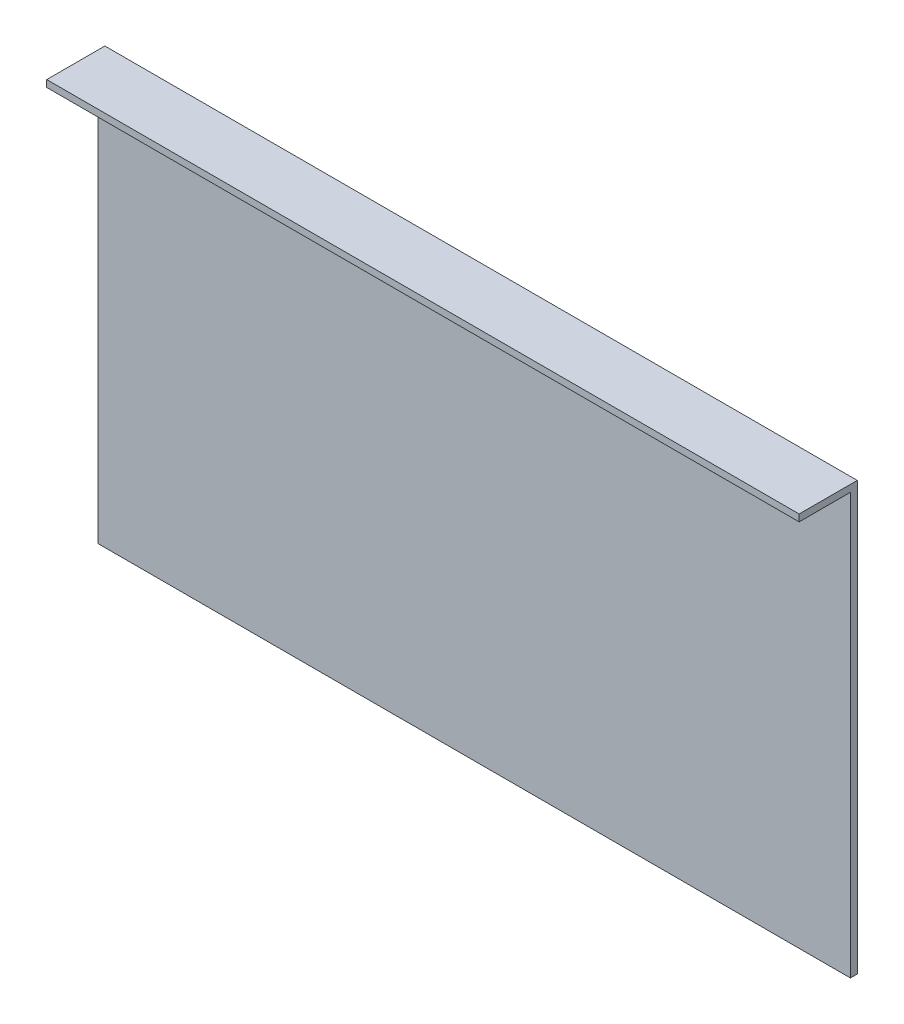
ISO-10303-21;
HEADER;
FILE_DESCRIPTION(('STEP AP214'),'2;1');
FILE_NAME('part.step','',(''),(''),'','','');
FILE_SCHEMA(('AUTOMOTIVE_DESIGN { 1 0 10303 214 1 1 1 1 }'));
ENDSEC;
DATA;
#1=APPLICATION_CONTEXT('core data for automotive mechanical design processes');
#2=APPLICATION_PROTOCOL_DEFINITION('international standard','automotive_design',2000,#1);
#3=PRODUCT_CONTEXT('',#1,'mechanical');
#4=PRODUCT('Part','Part','',(#3));
#5=PRODUCT_RELATED_PRODUCT_CATEGORY('part','',(#4));
#6=PRODUCT_DEFINITION_FORMATION('','',#4);
#7=PRODUCT_DEFINITION_CONTEXT('part definition',#1,'design');
#8=PRODUCT_DEFINITION('design','',#6,#7);
#9=PRODUCT_DEFINITION_SHAPE('','',#8);
#10=(LENGTH_UNIT() NAMED_UNIT(*) SI_UNIT(.MILLI.,.METRE.));
#11=(NAMED_UNIT(*) PLANE_ANGLE_UNIT() SI_UNIT($,.RADIAN.));
#12=(NAMED_UNIT(*) SI_UNIT($,.STERADIAN.) SOLID_ANGLE_UNIT());
#13=UNCERTAINTY_MEASURE_WITH_UNIT(LENGTH_MEASURE(1.E-05),#10,'distance_accuracy_value','');
#14=(GEOMETRIC_REPRESENTATION_CONTEXT(3) GLOBAL_UNCERTAINTY_ASSIGNED_CONTEXT((#13)) GLOBAL_UNIT_ASSIGNED_CONTEXT((#10,
#11,#12)) REPRESENTATION_CONTEXT('',''));
#15=CARTESIAN_POINT('',(0.,0.,0.));
#16=DIRECTION('',(0.,0.,1.));
#17=DIRECTION('',(1.,0.,0.));
#18=AXIS2_PLACEMENT_3D('',#15,#16,#17);
#19=CARTESIAN_POINT('',(0.,0.,4.));
#20=DIRECTION('',(0.,0.,-1.));
#21=DIRECTION('',(-1.,0.,0.));
#22=AXIS2_PLACEMENT_3D('',#19,#20,#21);
#23=PLANE('',#22);
#24=DIRECTION('',(1.,0.,0.));
#25=VECTOR('',#24,1.);
#26=CARTESIAN_POINT('',(0.,246.,4.));
#27=LINE('',#26,#25);
#28=CARTESIAN_POINT('',(0.,246.,4.));
#29=VERTEX_POINT('',#28);
#30=CARTESIAN_POINT('',(440.,246.,4.));
#31=VERTEX_POINT('',#30);
#32=EDGE_CURVE('E49',#29,#31,#27,.T.);
#33=ORIENTED_EDGE('',*,*,#32,.F.);
#34=DIRECTION('',(0.,-1.,0.));
#35=VECTOR('',#34,1.);
#36=CARTESIAN_POINT('',(0.,0.,4.));
#37=LINE('',#36,#35);
#38=CARTESIAN_POINT('',(0.,0.,4.));
#39=VERTEX_POINT('',#38);
#40=EDGE_CURVE('E86',#29,#39,#37,.T.);
#41=ORIENTED_EDGE('',*,*,#40,.T.);
#42=DIRECTION('',(1.,0.,0.));
#43=VECTOR('',#42,1.);
#44=CARTESIAN_POINT('',(0.,0.,4.));
#45=LINE('',#44,#43);
#46=CARTESIAN_POINT('',(440.,0.,4.));
#47=VERTEX_POINT('',#46);
#48=EDGE_CURVE('E55',#39,#47,#45,.T.);
#49=ORIENTED_EDGE('',*,*,#48,.T.);
#50=DIRECTION('',(0.,1.,0.));
#51=VECTOR('',#50,1.);
#52=CARTESIAN_POINT('',(440.,0.,4.));
#53=LINE('',#52,#51);
#54=EDGE_CURVE('E97',#47,#31,#53,.T.);
#55=ORIENTED_EDGE('',*,*,#54,.T.);
#56=EDGE_LOOP('',(#33,#41,#49,#55));
#57=FACE_BOUND('',#56,.T.);
#58=ADVANCED_FACE('F34',(#57),#23,.F.);
#59=CARTESIAN_POINT('',(0.,0.,4.));
#60=DIRECTION('',(1.,0.,0.));
#61=DIRECTION('',(0.,0.,-1.));
#62=AXIS2_PLACEMENT_3D('',#59,#60,#61);
#63=PLANE('',#62);
#64=DIRECTION('',(0.,-1.,0.));
#65=VECTOR('',#64,1.);
#66=CARTESIAN_POINT('',(0.,0.,0.));
#67=LINE('',#66,#65);
#68=CARTESIAN_POINT('',(0.,250.,0.));
#69=VERTEX_POINT('',#68);
#70=CARTESIAN_POINT('',(0.,0.,0.));
#71=VERTEX_POINT('',#70);
#72=EDGE_CURVE('E93',#69,#71,#67,.T.);
#73=ORIENTED_EDGE('',*,*,#72,.T.);
#74=DIRECTION('',(0.,0.,-1.));
#75=VECTOR('',#74,1.);
#76=CARTESIAN_POINT('',(0.,0.,4.));
#77=LINE('',#76,#75);
#78=EDGE_CURVE('E11',#39,#71,#77,.T.);
#79=ORIENTED_EDGE('',*,*,#78,.F.);
#80=ORIENTED_EDGE('',*,*,#40,.F.);
#81=DIRECTION('',(0.,0.,-1.));
#82=VECTOR('',#81,1.);
#83=CARTESIAN_POINT('',(0.,246.,34.));
#84=LINE('',#83,#82);
#85=CARTESIAN_POINT('',(0.,246.,34.));
#86=VERTEX_POINT('',#85);
#87=EDGE_CURVE('E101',#86,#29,#84,.T.);
#88=ORIENTED_EDGE('',*,*,#87,.F.);
#89=DIRECTION('',(0.,-1.,0.));
#90=VECTOR('',#89,1.);
#91=CARTESIAN_POINT('',(0.,250.,34.));
#92=LINE('',#91,#90);
#93=CARTESIAN_POINT('',(0.,250.,34.));
#94=VERTEX_POINT('',#93);
#95=EDGE_CURVE('E96',#94,#86,#92,.T.);
#96=ORIENTED_EDGE('',*,*,#95,.F.);
#97=DIRECTION('',(0.,0.,-1.));
#98=VECTOR('',#97,1.);
#99=CARTESIAN_POINT('',(0.,250.,4.));
#100=LINE('',#99,#98);
#101=EDGE_CURVE('E79',#94,#69,#100,.T.);
#102=ORIENTED_EDGE('',*,*,#101,.T.);
#103=EDGE_LOOP('',(#73,#79,#80,#88,#96,#102));
#104=FACE_BOUND('',#103,.T.);
#105=ADVANCED_FACE('F36',(#104),#63,.F.);
#106=CARTESIAN_POINT('',(0.,0.,4.));
#107=DIRECTION('',(0.,1.,0.));
#108=DIRECTION('',(0.,0.,1.));
#109=AXIS2_PLACEMENT_3D('',#106,#107,#108);
#110=PLANE('',#109);
#111=DIRECTION('',(1.,0.,0.));
#112=VECTOR('',#111,1.);
#113=CARTESIAN_POINT('',(0.,0.,0.));
#114=LINE('',#113,#112);
#115=CARTESIAN_POINT('',(440.,0.,0.));
#116=VERTEX_POINT('',#115);
#117=EDGE_CURVE('E100',#71,#116,#114,.T.);
#118=ORIENTED_EDGE('',*,*,#117,.T.);
#119=DIRECTION('',(0.,0.,-1.));
#120=VECTOR('',#119,1.);
#121=CARTESIAN_POINT('',(440.,0.,4.));
#122=LINE('',#121,#120);
#123=EDGE_CURVE('E42',#47,#116,#122,.T.);
#124=ORIENTED_EDGE('',*,*,#123,.F.);
#125=ORIENTED_EDGE('',*,*,#48,.F.);
#126=ORIENTED_EDGE('',*,*,#78,.T.);
#127=EDGE_LOOP('',(#118,#124,#125,#126));
#128=FACE_BOUND('',#127,.T.);
#129=ADVANCED_FACE('F117',(#128),#110,.F.);
#130=CARTESIAN_POINT('',(440.,0.,4.));
#131=DIRECTION('',(-1.,0.,0.));
#132=DIRECTION('',(0.,0.,1.));
#133=AXIS2_PLACEMENT_3D('',#130,#131,#132);
#134=PLANE('',#133);
#135=DIRECTION('',(0.,1.,0.));
#136=VECTOR('',#135,1.);
#137=CARTESIAN_POINT('',(440.,0.,0.));
#138=LINE('',#137,#136);
#139=CARTESIAN_POINT('',(440.,250.,0.));
#140=VERTEX_POINT('',#139);
#141=EDGE_CURVE('E87',#116,#140,#138,.T.);
#142=ORIENTED_EDGE('',*,*,#141,.T.);
#143=DIRECTION('',(0.,0.,-1.));
#144=VECTOR('',#143,1.);
#145=CARTESIAN_POINT('',(440.,250.,4.));
#146=LINE('',#145,#144);
#147=CARTESIAN_POINT('',(440.,250.,34.));
#148=VERTEX_POINT('',#147);
#149=EDGE_CURVE('E82',#148,#140,#146,.T.);
#150=ORIENTED_EDGE('',*,*,#149,.F.);
#151=DIRECTION('',(0.,1.,0.));
#152=VECTOR('',#151,1.);
#153=CARTESIAN_POINT('',(440.,250.,34.));
#154=LINE('',#153,#152);
#155=CARTESIAN_POINT('',(440.,246.,34.));
#156=VERTEX_POINT('',#155);
#157=EDGE_CURVE('E132',#156,#148,#154,.T.);
#158=ORIENTED_EDGE('',*,*,#157,.F.);
#159=DIRECTION('',(0.,0.,-1.));
#160=VECTOR('',#159,1.);
#161=CARTESIAN_POINT('',(440.,246.,34.));
#162=LINE('',#161,#160);
#163=EDGE_CURVE('E105',#156,#31,#162,.T.);
#164=ORIENTED_EDGE('',*,*,#163,.T.);
#165=ORIENTED_EDGE('',*,*,#54,.F.);
#166=ORIENTED_EDGE('',*,*,#123,.T.);
#167=EDGE_LOOP('',(#142,#150,#158,#164,#165,#166));
#168=FACE_BOUND('',#167,.T.);
#169=ADVANCED_FACE('F114',(#168),#134,.F.);
#170=CARTESIAN_POINT('',(0.,250.,4.));
#171=DIRECTION('',(0.,-1.,0.));
#172=DIRECTION('',(0.,0.,-1.));
#173=AXIS2_PLACEMENT_3D('',#170,#171,#172);
#174=PLANE('',#173);
#175=DIRECTION('',(-1.,0.,0.));
#176=VECTOR('',#175,1.);
#177=CARTESIAN_POINT('',(0.,250.,0.));
#178=LINE('',#177,#176);
#179=EDGE_CURVE('E75',#140,#69,#178,.T.);
#180=ORIENTED_EDGE('',*,*,#179,.T.);
#181=ORIENTED_EDGE('',*,*,#101,.F.);
#182=DIRECTION('',(-1.,0.,0.));
#183=VECTOR('',#182,1.);
#184=CARTESIAN_POINT('',(0.,250.,34.));
#185=LINE('',#184,#183);
#186=EDGE_CURVE('E135',#148,#94,#185,.T.);
#187=ORIENTED_EDGE('',*,*,#186,.F.);
#188=ORIENTED_EDGE('',*,*,#149,.T.);
#189=EDGE_LOOP('',(#180,#181,#187,#188));
#190=FACE_BOUND('',#189,.T.);
#191=ADVANCED_FACE('F77',(#190),#174,.F.);
#192=CARTESIAN_POINT('',(0.,0.,0.));
#193=DIRECTION('',(0.,0.,-1.));
#194=DIRECTION('',(-1.,0.,0.));
#195=AXIS2_PLACEMENT_3D('',#192,#193,#194);
#196=PLANE('',#195);
#197=ORIENTED_EDGE('',*,*,#72,.F.);
#198=ORIENTED_EDGE('',*,*,#179,.F.);
#199=ORIENTED_EDGE('',*,*,#141,.F.);
#200=ORIENTED_EDGE('',*,*,#117,.F.);
#201=EDGE_LOOP('',(#197,#198,#199,#200));
#202=FACE_BOUND('',#201,.T.);
#203=ADVANCED_FACE('F99',(#202),#196,.T.);
#204=CARTESIAN_POINT('',(0.,246.,34.));
#205=DIRECTION('',(0.,1.,0.));
#206=DIRECTION('',(0.,0.,1.));
#207=AXIS2_PLACEMENT_3D('',#204,#205,#206);
#208=PLANE('',#207);
#209=ORIENTED_EDGE('',*,*,#32,.T.);
#210=ORIENTED_EDGE('',*,*,#163,.F.);
#211=DIRECTION('',(1.,0.,0.));
#212=VECTOR('',#211,1.);
#213=CARTESIAN_POINT('',(0.,246.,34.));
#214=LINE('',#213,#212);
#215=EDGE_CURVE('E126',#86,#156,#214,.T.);
#216=ORIENTED_EDGE('',*,*,#215,.F.);
#217=ORIENTED_EDGE('',*,*,#87,.T.);
#218=EDGE_LOOP('',(#209,#210,#216,#217));
#219=FACE_BOUND('',#218,.T.);
#220=ADVANCED_FACE('F122',(#219),#208,.F.);
#221=CARTESIAN_POINT('',(0.,0.,34.));
#222=DIRECTION('',(0.,0.,1.));
#223=DIRECTION('',(1.,0.,0.));
#224=AXIS2_PLACEMENT_3D('',#221,#222,#223);
#225=PLANE('',#224);
#226=ORIENTED_EDGE('',*,*,#95,.T.);
#227=ORIENTED_EDGE('',*,*,#215,.T.);
#228=ORIENTED_EDGE('',*,*,#157,.T.);
#229=ORIENTED_EDGE('',*,*,#186,.T.);
#230=EDGE_LOOP('',(#226,#227,#228,#229));
#231=FACE_BOUND('',#230,.T.);
#232=ADVANCED_FACE('F134',(#231),#225,.T.);
#233=CLOSED_SHELL('',(#58,#105,#129,#169,#191,#203,#220,#232));
#234=MANIFOLD_SOLID_BREP('B2',#233);
#235=ADVANCED_BREP_SHAPE_REPRESENTATION('',(#18,#234),#14);
#236=SHAPE_DEFINITION_REPRESENTATION(#9,#235);
ENDSEC;
END-ISO-10303-21;
